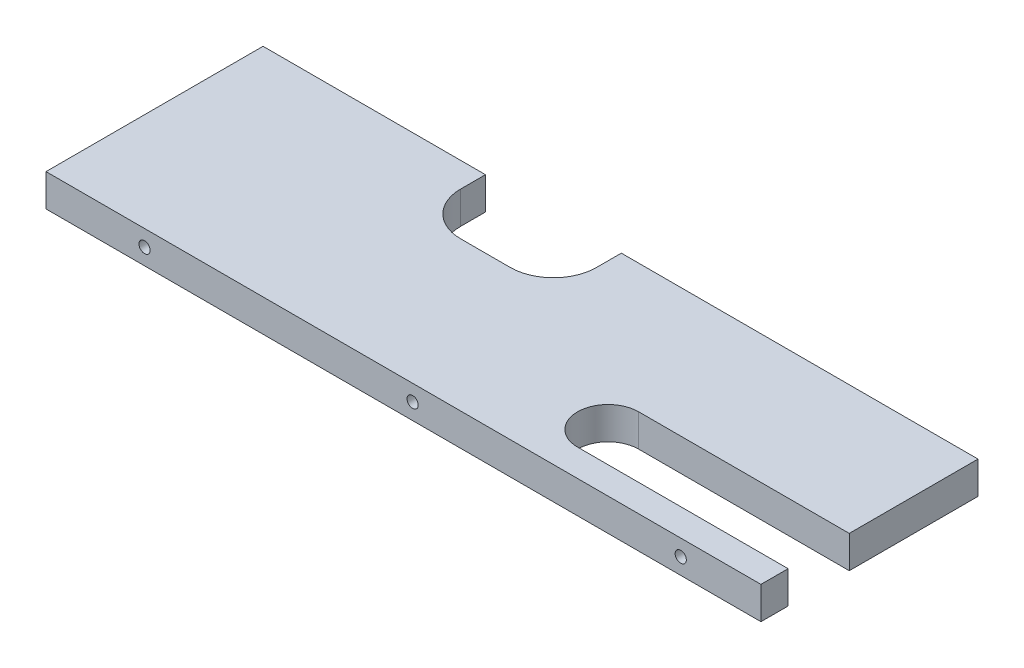
ISO-10303-21;
HEADER;
FILE_DESCRIPTION(('STEP AP214'),'2;1');
FILE_NAME('part.step','',(''),(''),'','','');
FILE_SCHEMA(('AUTOMOTIVE_DESIGN { 1 0 10303 214 1 1 1 1 }'));
ENDSEC;
DATA;
#1=APPLICATION_CONTEXT('core data for automotive mechanical design processes');
#2=APPLICATION_PROTOCOL_DEFINITION('international standard','automotive_design',2000,#1);
#3=PRODUCT_CONTEXT('',#1,'mechanical');
#4=PRODUCT('Part','Part','',(#3));
#5=PRODUCT_RELATED_PRODUCT_CATEGORY('part','',(#4));
#6=PRODUCT_DEFINITION_FORMATION('','',#4);
#7=PRODUCT_DEFINITION_CONTEXT('part definition',#1,'design');
#8=PRODUCT_DEFINITION('design','',#6,#7);
#9=PRODUCT_DEFINITION_SHAPE('','',#8);
#10=(LENGTH_UNIT() NAMED_UNIT(*) SI_UNIT(.MILLI.,.METRE.));
#11=(NAMED_UNIT(*) PLANE_ANGLE_UNIT() SI_UNIT($,.RADIAN.));
#12=(NAMED_UNIT(*) SI_UNIT($,.STERADIAN.) SOLID_ANGLE_UNIT());
#13=UNCERTAINTY_MEASURE_WITH_UNIT(LENGTH_MEASURE(1.E-05),#10,'distance_accuracy_value','');
#14=(GEOMETRIC_REPRESENTATION_CONTEXT(3) GLOBAL_UNCERTAINTY_ASSIGNED_CONTEXT((#13)) GLOBAL_UNIT_ASSIGNED_CONTEXT((#10,
#11,#12)) REPRESENTATION_CONTEXT('',''));
#15=CARTESIAN_POINT('',(0.,0.,0.));
#16=DIRECTION('',(0.,0.,1.));
#17=DIRECTION('',(1.,0.,0.));
#18=AXIS2_PLACEMENT_3D('',#15,#16,#17);
#19=CARTESIAN_POINT('',(105.2375,4.7625,63.9));
#20=DIRECTION('',(-1.,0.,0.));
#21=DIRECTION('',(0.,0.,1.));
#22=AXIS2_PLACEMENT_3D('',#19,#20,#21);
#23=PLANE('',#22);
#24=DIRECTION('',(0.,0.,-1.));
#25=VECTOR('',#24,1.);
#26=CARTESIAN_POINT('',(105.2375,4.7625,63.9));
#27=LINE('',#26,#25);
#28=CARTESIAN_POINT('',(105.2375,4.7625,37.9));
#29=VERTEX_POINT('',#28);
#30=CARTESIAN_POINT('',(105.2375,4.7625,0.));
#31=VERTEX_POINT('',#30);
#32=EDGE_CURVE('E240',#29,#31,#27,.T.);
#33=ORIENTED_EDGE('',*,*,#32,.F.);
#34=DIRECTION('',(0.,1.,0.));
#35=VECTOR('',#34,1.);
#36=CARTESIAN_POINT('',(105.2375,-4.7625,37.9));
#37=LINE('',#36,#35);
#38=CARTESIAN_POINT('',(105.2375,-4.7625,37.9));
#39=VERTEX_POINT('',#38);
#40=EDGE_CURVE('E177',#39,#29,#37,.T.);
#41=ORIENTED_EDGE('',*,*,#40,.F.);
#42=DIRECTION('',(0.,0.,-1.));
#43=VECTOR('',#42,1.);
#44=CARTESIAN_POINT('',(105.2375,-4.7625,63.9));
#45=LINE('',#44,#43);
#46=CARTESIAN_POINT('',(105.2375,-4.7625,0.));
#47=VERTEX_POINT('',#46);
#48=EDGE_CURVE('E244',#39,#47,#45,.T.);
#49=ORIENTED_EDGE('',*,*,#48,.T.);
#50=DIRECTION('',(0.,1.,0.));
#51=VECTOR('',#50,1.);
#52=CARTESIAN_POINT('',(105.2375,4.7625,0.));
#53=LINE('',#52,#51);
#54=EDGE_CURVE('E232',#47,#31,#53,.T.);
#55=ORIENTED_EDGE('',*,*,#54,.T.);
#56=EDGE_LOOP('',(#33,#41,#49,#55));
#57=FACE_BOUND('',#56,.T.);
#58=ADVANCED_FACE('F38',(#57),#23,.F.);
#59=CARTESIAN_POINT('',(0.,0.,0.));
#60=DIRECTION('',(0.,0.,1.));
#61=DIRECTION('',(1.,0.,0.));
#62=AXIS2_PLACEMENT_3D('',#59,#60,#61);
#63=PLANE('',#62);
#64=DIRECTION('',(-1.,0.,0.));
#65=VECTOR('',#64,1.);
#66=CARTESIAN_POINT('',(-105.2375,4.7625,0.));
#67=LINE('',#66,#65);
#68=CARTESIAN_POINT('',(-39.7625,4.7625,0.));
#69=VERTEX_POINT('',#68);
#70=CARTESIAN_POINT('',(-105.2375,4.7625,0.));
#71=VERTEX_POINT('',#70);
#72=EDGE_CURVE('E235',#69,#71,#67,.T.);
#73=ORIENTED_EDGE('',*,*,#72,.F.);
#74=DIRECTION('',(0.,1.,0.));
#75=VECTOR('',#74,1.);
#76=CARTESIAN_POINT('',(-39.7625,-4.7625,0.));
#77=LINE('',#76,#75);
#78=CARTESIAN_POINT('',(-39.7625,-4.7625,0.));
#79=VERTEX_POINT('',#78);
#80=EDGE_CURVE('E210',#79,#69,#77,.T.);
#81=ORIENTED_EDGE('',*,*,#80,.F.);
#82=DIRECTION('',(1.,0.,0.));
#83=VECTOR('',#82,1.);
#84=CARTESIAN_POINT('',(-105.2375,-4.7625,0.));
#85=LINE('',#84,#83);
#86=CARTESIAN_POINT('',(-105.2375,-4.7625,0.));
#87=VERTEX_POINT('',#86);
#88=EDGE_CURVE('E229',#87,#79,#85,.T.);
#89=ORIENTED_EDGE('',*,*,#88,.F.);
#90=DIRECTION('',(0.,-1.,0.));
#91=VECTOR('',#90,1.);
#92=CARTESIAN_POINT('',(-105.2375,4.7625,0.));
#93=LINE('',#92,#91);
#94=EDGE_CURVE('E212',#71,#87,#93,.T.);
#95=ORIENTED_EDGE('',*,*,#94,.F.);
#96=EDGE_LOOP('',(#73,#81,#89,#95));
#97=FACE_BOUND('',#96,.T.);
#98=ADVANCED_FACE('F312',(#97),#63,.F.);
#99=CARTESIAN_POINT('',(-105.2375,4.7625,63.9));
#100=DIRECTION('',(1.,0.,0.));
#101=DIRECTION('',(0.,0.,-1.));
#102=AXIS2_PLACEMENT_3D('',#99,#100,#101);
#103=PLANE('',#102);
#104=ORIENTED_EDGE('',*,*,#94,.T.);
#105=DIRECTION('',(0.,0.,-1.));
#106=VECTOR('',#105,1.);
#107=CARTESIAN_POINT('',(-105.2375,-4.7625,63.9));
#108=LINE('',#107,#106);
#109=CARTESIAN_POINT('',(-105.2375,-4.7625,63.9));
#110=VERTEX_POINT('',#109);
#111=EDGE_CURVE('E247',#110,#87,#108,.T.);
#112=ORIENTED_EDGE('',*,*,#111,.F.);
#113=DIRECTION('',(0.,-1.,0.));
#114=VECTOR('',#113,1.);
#115=CARTESIAN_POINT('',(-105.2375,4.7625,63.9));
#116=LINE('',#115,#114);
#117=CARTESIAN_POINT('',(-105.2375,4.7625,63.9));
#118=VERTEX_POINT('',#117);
#119=EDGE_CURVE('E215',#118,#110,#116,.T.);
#120=ORIENTED_EDGE('',*,*,#119,.F.);
#121=DIRECTION('',(0.,0.,-1.));
#122=VECTOR('',#121,1.);
#123=CARTESIAN_POINT('',(-105.2375,4.7625,63.9));
#124=LINE('',#123,#122);
#125=EDGE_CURVE('E225',#118,#71,#124,.T.);
#126=ORIENTED_EDGE('',*,*,#125,.T.);
#127=EDGE_LOOP('',(#104,#112,#120,#126));
#128=FACE_BOUND('',#127,.T.);
#129=ADVANCED_FACE('F309',(#128),#103,.F.);
#130=CARTESIAN_POINT('',(-105.2375,-4.7625,63.9));
#131=DIRECTION('',(0.,1.,0.));
#132=DIRECTION('',(0.,0.,1.));
#133=AXIS2_PLACEMENT_3D('',#130,#131,#132);
#134=PLANE('',#133);
#135=ORIENTED_EDGE('',*,*,#48,.F.);
#136=DIRECTION('',(-1.,0.,0.));
#137=VECTOR('',#136,1.);
#138=CARTESIAN_POINT('',(43.2375,-4.7625,37.9));
#139=LINE('',#138,#137);
#140=CARTESIAN_POINT('',(43.2375,-4.7625,37.9));
#141=VERTEX_POINT('',#140);
#142=EDGE_CURVE('E153',#39,#141,#139,.T.);
#143=ORIENTED_EDGE('',*,*,#142,.T.);
#144=CARTESIAN_POINT('',(43.2375,-4.7625,46.9));
#145=DIRECTION('',(0.,1.,0.));
#146=DIRECTION('',(0.,0.,1.));
#147=AXIS2_PLACEMENT_3D('',#144,#145,#146);
#148=CIRCLE('',#147,9.);
#149=CARTESIAN_POINT('',(43.2375,-4.7625,55.9));
#150=VERTEX_POINT('',#149);
#151=EDGE_CURVE('E148',#141,#150,#148,.T.);
#152=ORIENTED_EDGE('',*,*,#151,.T.);
#153=DIRECTION('',(1.,0.,0.));
#154=VECTOR('',#153,1.);
#155=CARTESIAN_POINT('',(43.2375,-4.7625,55.9));
#156=LINE('',#155,#154);
#157=CARTESIAN_POINT('',(105.2375,-4.7625,55.9));
#158=VERTEX_POINT('',#157);
#159=EDGE_CURVE('E156',#150,#158,#156,.T.);
#160=ORIENTED_EDGE('',*,*,#159,.T.);
#161=CARTESIAN_POINT('',(105.2375,-4.7625,63.9));
#162=VERTEX_POINT('',#161);
#163=EDGE_CURVE('E245',#162,#158,#45,.T.);
#164=ORIENTED_EDGE('',*,*,#163,.F.);
#165=DIRECTION('',(1.,0.,0.));
#166=VECTOR('',#165,1.);
#167=CARTESIAN_POINT('',(-105.2375,-4.7625,63.9));
#168=LINE('',#167,#166);
#169=EDGE_CURVE('E218',#110,#162,#168,.T.);
#170=ORIENTED_EDGE('',*,*,#169,.F.);
#171=ORIENTED_EDGE('',*,*,#111,.T.);
#172=ORIENTED_EDGE('',*,*,#88,.T.);
#173=DIRECTION('',(0.,0.,1.));
#174=VECTOR('',#173,1.);
#175=CARTESIAN_POINT('',(-39.7625,-4.7625,0.));
#176=LINE('',#175,#174);
#177=CARTESIAN_POINT('',(-39.7625,-4.7625,7.3));
#178=VERTEX_POINT('',#177);
#179=EDGE_CURVE('E196',#79,#178,#176,.T.);
#180=ORIENTED_EDGE('',*,*,#179,.T.);
#181=CARTESIAN_POINT('',(-27.0625,-4.7625,7.3));
#182=DIRECTION('',(0.,1.,0.));
#183=DIRECTION('',(0.,0.,1.));
#184=AXIS2_PLACEMENT_3D('',#181,#182,#183);
#185=CIRCLE('',#184,12.7);
#186=CARTESIAN_POINT('',(-27.0625,-4.7625,20.));
#187=VERTEX_POINT('',#186);
#188=EDGE_CURVE('E11',#178,#187,#185,.T.);
#189=ORIENTED_EDGE('',*,*,#188,.T.);
#190=DIRECTION('',(1.,0.,0.));
#191=VECTOR('',#190,1.);
#192=CARTESIAN_POINT('',(-39.7625,-4.7625,20.));
#193=LINE('',#192,#191);
#194=CARTESIAN_POINT('',(-12.4625,-4.7625,20.));
#195=VERTEX_POINT('',#194);
#196=EDGE_CURVE('E198',#187,#195,#193,.T.);
#197=ORIENTED_EDGE('',*,*,#196,.T.);
#198=CARTESIAN_POINT('',(-12.4625,-4.7625,7.3));
#199=DIRECTION('',(0.,1.,0.));
#200=DIRECTION('',(0.,0.,1.));
#201=AXIS2_PLACEMENT_3D('',#198,#199,#200);
#202=CIRCLE('',#201,12.7);
#203=CARTESIAN_POINT('',(0.237500000000003,-4.7625,7.3));
#204=VERTEX_POINT('',#203);
#205=EDGE_CURVE('E261',#195,#204,#202,.T.);
#206=ORIENTED_EDGE('',*,*,#205,.T.);
#207=DIRECTION('',(0.,0.,-1.));
#208=VECTOR('',#207,1.);
#209=CARTESIAN_POINT('',(0.237500000000002,-4.7625,0.));
#210=LINE('',#209,#208);
#211=CARTESIAN_POINT('',(0.237500000000002,-4.7625,0.));
#212=VERTEX_POINT('',#211);
#213=EDGE_CURVE('E202',#204,#212,#210,.T.);
#214=ORIENTED_EDGE('',*,*,#213,.T.);
#215=EDGE_CURVE('E228',#212,#47,#85,.T.);
#216=ORIENTED_EDGE('',*,*,#215,.T.);
#217=EDGE_LOOP('',(#135,#143,#152,#160,#164,#170,#171,#172,#180,#189,#197,#206,#214,#216));
#218=FACE_BOUND('',#217,.T.);
#219=ADVANCED_FACE('F165',(#218),#134,.F.);
#220=ORIENTED_EDGE('',*,*,#163,.T.);
#221=DIRECTION('',(0.,1.,0.));
#222=VECTOR('',#221,1.);
#223=CARTESIAN_POINT('',(105.2375,-4.7625,55.9));
#224=LINE('',#223,#222);
#225=CARTESIAN_POINT('',(105.2375,4.7625,55.9));
#226=VERTEX_POINT('',#225);
#227=EDGE_CURVE('E152',#158,#226,#224,.T.);
#228=ORIENTED_EDGE('',*,*,#227,.T.);
#229=CARTESIAN_POINT('',(105.2375,4.7625,63.9));
#230=VERTEX_POINT('',#229);
#231=EDGE_CURVE('E241',#230,#226,#27,.T.);
#232=ORIENTED_EDGE('',*,*,#231,.F.);
#233=DIRECTION('',(0.,1.,0.));
#234=VECTOR('',#233,1.);
#235=CARTESIAN_POINT('',(105.2375,4.7625,63.9));
#236=LINE('',#235,#234);
#237=EDGE_CURVE('E221',#162,#230,#236,.T.);
#238=ORIENTED_EDGE('',*,*,#237,.F.);
#239=EDGE_LOOP('',(#220,#228,#232,#238));
#240=FACE_BOUND('',#239,.T.);
#241=ADVANCED_FACE('F301',(#240),#23,.F.);
#242=CARTESIAN_POINT('',(-105.2375,4.7625,63.9));
#243=DIRECTION('',(0.,-1.,0.));
#244=DIRECTION('',(0.,0.,-1.));
#245=AXIS2_PLACEMENT_3D('',#242,#243,#244);
#246=PLANE('',#245);
#247=CARTESIAN_POINT('',(43.2375,4.7625,46.9));
#248=DIRECTION('',(0.,1.,0.));
#249=DIRECTION('',(0.,0.,1.));
#250=AXIS2_PLACEMENT_3D('',#247,#248,#249);
#251=CIRCLE('',#250,9.);
#252=CARTESIAN_POINT('',(43.2375,4.7625,37.9));
#253=VERTEX_POINT('',#252);
#254=CARTESIAN_POINT('',(43.2375,4.7625,55.9));
#255=VERTEX_POINT('',#254);
#256=EDGE_CURVE('E54',#253,#255,#251,.T.);
#257=ORIENTED_EDGE('',*,*,#256,.F.);
#258=DIRECTION('',(-1.,0.,0.));
#259=VECTOR('',#258,1.);
#260=CARTESIAN_POINT('',(43.2375,4.7625,37.9));
#261=LINE('',#260,#259);
#262=EDGE_CURVE('E166',#29,#253,#261,.T.);
#263=ORIENTED_EDGE('',*,*,#262,.F.);
#264=ORIENTED_EDGE('',*,*,#32,.T.);
#265=CARTESIAN_POINT('',(0.237500000000002,4.7625,0.));
#266=VERTEX_POINT('',#265);
#267=EDGE_CURVE('E219',#31,#266,#67,.T.);
#268=ORIENTED_EDGE('',*,*,#267,.T.);
#269=DIRECTION('',(0.,0.,-1.));
#270=VECTOR('',#269,1.);
#271=CARTESIAN_POINT('',(0.237500000000002,4.7625,0.));
#272=LINE('',#271,#270);
#273=CARTESIAN_POINT('',(0.237500000000003,4.7625,7.3));
#274=VERTEX_POINT('',#273);
#275=EDGE_CURVE('E199',#274,#266,#272,.T.);
#276=ORIENTED_EDGE('',*,*,#275,.F.);
#277=CARTESIAN_POINT('',(-12.4625,4.7625,7.3));
#278=DIRECTION('',(0.,-1.,0.));
#279=DIRECTION('',(0.,0.,-1.));
#280=AXIS2_PLACEMENT_3D('',#277,#278,#279);
#281=CIRCLE('',#280,12.7);
#282=CARTESIAN_POINT('',(-12.4625,4.7625,20.));
#283=VERTEX_POINT('',#282);
#284=EDGE_CURVE('E259',#274,#283,#281,.T.);
#285=ORIENTED_EDGE('',*,*,#284,.T.);
#286=DIRECTION('',(1.,0.,0.));
#287=VECTOR('',#286,1.);
#288=CARTESIAN_POINT('',(-39.7625,4.7625,20.));
#289=LINE('',#288,#287);
#290=CARTESIAN_POINT('',(-27.0625,4.7625,20.));
#291=VERTEX_POINT('',#290);
#292=EDGE_CURVE('E206',#291,#283,#289,.T.);
#293=ORIENTED_EDGE('',*,*,#292,.F.);
#294=CARTESIAN_POINT('',(-27.0625,4.7625,7.3));
#295=DIRECTION('',(0.,-1.,0.));
#296=DIRECTION('',(0.,0.,-1.));
#297=AXIS2_PLACEMENT_3D('',#294,#295,#296);
#298=CIRCLE('',#297,12.7);
#299=CARTESIAN_POINT('',(-39.7625,4.7625,7.3));
#300=VERTEX_POINT('',#299);
#301=EDGE_CURVE('E47',#291,#300,#298,.T.);
#302=ORIENTED_EDGE('',*,*,#301,.T.);
#303=DIRECTION('',(0.,0.,1.));
#304=VECTOR('',#303,1.);
#305=CARTESIAN_POINT('',(-39.7625,4.7625,0.));
#306=LINE('',#305,#304);
#307=EDGE_CURVE('E195',#69,#300,#306,.T.);
#308=ORIENTED_EDGE('',*,*,#307,.F.);
#309=ORIENTED_EDGE('',*,*,#72,.T.);
#310=ORIENTED_EDGE('',*,*,#125,.F.);
#311=DIRECTION('',(-1.,0.,0.));
#312=VECTOR('',#311,1.);
#313=CARTESIAN_POINT('',(-105.2375,4.7625,63.9));
#314=LINE('',#313,#312);
#315=EDGE_CURVE('E223',#230,#118,#314,.T.);
#316=ORIENTED_EDGE('',*,*,#315,.F.);
#317=ORIENTED_EDGE('',*,*,#231,.T.);
#318=DIRECTION('',(1.,0.,0.));
#319=VECTOR('',#318,1.);
#320=CARTESIAN_POINT('',(43.2375,4.7625,55.9));
#321=LINE('',#320,#319);
#322=EDGE_CURVE('E169',#255,#226,#321,.T.);
#323=ORIENTED_EDGE('',*,*,#322,.F.);
#324=EDGE_LOOP('',(#257,#263,#264,#268,#276,#285,#293,#302,#308,#309,#310,#316,#317,#323));
#325=FACE_BOUND('',#324,.T.);
#326=ADVANCED_FACE('F266',(#325),#246,.F.);
#327=CARTESIAN_POINT('',(0.,0.,63.9));
#328=DIRECTION('',(0.,0.,1.));
#329=DIRECTION('',(1.,0.,0.));
#330=AXIS2_PLACEMENT_3D('',#327,#328,#329);
#331=PLANE('',#330);
#332=CARTESIAN_POINT('',(-76.2285,0.,63.9));
#333=DIRECTION('',(0.,0.,1.));
#334=DIRECTION('',(1.,0.,0.));
#335=AXIS2_PLACEMENT_3D('',#332,#333,#334);
#336=CIRCLE('',#335,1.65);
#337=CARTESIAN_POINT('',(-74.5785,0.,63.9));
#338=VERTEX_POINT('',#337);
#339=EDGE_CURVE('E180',#338,#338,#336,.T.);
#340=ORIENTED_EDGE('',*,*,#339,.F.);
#341=EDGE_LOOP('',(#340));
#342=FACE_BOUND('',#341,.T.);
#343=CARTESIAN_POINT('',(2.69949999999999,0.,63.9));
#344=DIRECTION('',(0.,0.,1.));
#345=DIRECTION('',(1.,0.,0.));
#346=AXIS2_PLACEMENT_3D('',#343,#344,#345);
#347=CIRCLE('',#346,1.64999999999999);
#348=CARTESIAN_POINT('',(4.34949999999999,0.,63.9));
#349=VERTEX_POINT('',#348);
#350=EDGE_CURVE('E186',#349,#349,#347,.T.);
#351=ORIENTED_EDGE('',*,*,#350,.F.);
#352=EDGE_LOOP('',(#351));
#353=FACE_BOUND('',#352,.T.);
#354=CARTESIAN_POINT('',(81.6285,0.,63.9));
#355=DIRECTION('',(0.,0.,1.));
#356=DIRECTION('',(1.,0.,0.));
#357=AXIS2_PLACEMENT_3D('',#354,#355,#356);
#358=CIRCLE('',#357,1.65);
#359=CARTESIAN_POINT('',(83.2785,0.,63.9));
#360=VERTEX_POINT('',#359);
#361=EDGE_CURVE('E192',#360,#360,#358,.T.);
#362=ORIENTED_EDGE('',*,*,#361,.F.);
#363=EDGE_LOOP('',(#362));
#364=FACE_BOUND('',#363,.T.);
#365=ORIENTED_EDGE('',*,*,#119,.T.);
#366=ORIENTED_EDGE('',*,*,#169,.T.);
#367=ORIENTED_EDGE('',*,*,#237,.T.);
#368=ORIENTED_EDGE('',*,*,#315,.T.);
#369=EDGE_LOOP('',(#365,#366,#367,#368));
#370=FACE_BOUND('',#369,.T.);
#371=ADVANCED_FACE('F306',(#342,#353,#364,#370),#331,.T.);
#372=ORIENTED_EDGE('',*,*,#215,.F.);
#373=DIRECTION('',(0.,1.,0.));
#374=VECTOR('',#373,1.);
#375=CARTESIAN_POINT('',(0.237500000000002,-4.7625,0.));
#376=LINE('',#375,#374);
#377=EDGE_CURVE('E204',#212,#266,#376,.T.);
#378=ORIENTED_EDGE('',*,*,#377,.T.);
#379=ORIENTED_EDGE('',*,*,#267,.F.);
#380=ORIENTED_EDGE('',*,*,#54,.F.);
#381=EDGE_LOOP('',(#372,#378,#379,#380));
#382=FACE_BOUND('',#381,.T.);
#383=ADVANCED_FACE('F291',(#382),#63,.F.);
#384=CARTESIAN_POINT('',(-39.7625,-4.7625,0.));
#385=DIRECTION('',(-1.,0.,0.));
#386=DIRECTION('',(0.,0.,1.));
#387=AXIS2_PLACEMENT_3D('',#384,#385,#386);
#388=PLANE('',#387);
#389=ORIENTED_EDGE('',*,*,#307,.T.);
#390=DIRECTION('',(0.,1.,0.));
#391=VECTOR('',#390,1.);
#392=CARTESIAN_POINT('',(-39.7625,-4.7625,7.3));
#393=LINE('',#392,#391);
#394=EDGE_CURVE('E62',#300,#178,#393,.F.);
#395=ORIENTED_EDGE('',*,*,#394,.T.);
#396=ORIENTED_EDGE('',*,*,#179,.F.);
#397=ORIENTED_EDGE('',*,*,#80,.T.);
#398=EDGE_LOOP('',(#389,#395,#396,#397));
#399=FACE_BOUND('',#398,.T.);
#400=ADVANCED_FACE('F270',(#399),#388,.F.);
#401=CARTESIAN_POINT('',(0.237500000000002,-4.7625,0.));
#402=DIRECTION('',(1.,0.,0.));
#403=DIRECTION('',(0.,0.,-1.));
#404=AXIS2_PLACEMENT_3D('',#401,#402,#403);
#405=PLANE('',#404);
#406=ORIENTED_EDGE('',*,*,#213,.F.);
#407=DIRECTION('',(0.,1.,0.));
#408=VECTOR('',#407,1.);
#409=CARTESIAN_POINT('',(0.237500000000003,4.7625,7.3));
#410=LINE('',#409,#408);
#411=EDGE_CURVE('E250',#204,#274,#410,.T.);
#412=ORIENTED_EDGE('',*,*,#411,.T.);
#413=ORIENTED_EDGE('',*,*,#275,.T.);
#414=ORIENTED_EDGE('',*,*,#377,.F.);
#415=EDGE_LOOP('',(#406,#412,#413,#414));
#416=FACE_BOUND('',#415,.T.);
#417=ADVANCED_FACE('F285',(#416),#405,.F.);
#418=CARTESIAN_POINT('',(-39.7625,-4.7625,20.));
#419=DIRECTION('',(0.,0.,1.));
#420=DIRECTION('',(1.,0.,0.));
#421=AXIS2_PLACEMENT_3D('',#418,#419,#420);
#422=PLANE('',#421);
#423=ORIENTED_EDGE('',*,*,#292,.T.);
#424=DIRECTION('',(0.,1.,0.));
#425=VECTOR('',#424,1.);
#426=CARTESIAN_POINT('',(-12.4625,-4.7625,20.));
#427=LINE('',#426,#425);
#428=EDGE_CURVE('E256',#283,#195,#427,.F.);
#429=ORIENTED_EDGE('',*,*,#428,.T.);
#430=ORIENTED_EDGE('',*,*,#196,.F.);
#431=DIRECTION('',(0.,1.,0.));
#432=VECTOR('',#431,1.);
#433=CARTESIAN_POINT('',(-27.0625,4.7625,20.));
#434=LINE('',#433,#432);
#435=EDGE_CURVE('E253',#187,#291,#434,.T.);
#436=ORIENTED_EDGE('',*,*,#435,.T.);
#437=EDGE_LOOP('',(#423,#429,#430,#436));
#438=FACE_BOUND('',#437,.T.);
#439=ADVANCED_FACE('F276',(#438),#422,.F.);
#440=CARTESIAN_POINT('',(-12.4625,-4.7625,7.3));
#441=DIRECTION('',(0.,-1.,0.));
#442=DIRECTION('',(0.,0.,-1.));
#443=AXIS2_PLACEMENT_3D('',#440,#441,#442);
#444=CYLINDRICAL_SURFACE('',#443,12.7);
#445=ORIENTED_EDGE('',*,*,#205,.F.);
#446=ORIENTED_EDGE('',*,*,#428,.F.);
#447=ORIENTED_EDGE('',*,*,#284,.F.);
#448=ORIENTED_EDGE('',*,*,#411,.F.);
#449=EDGE_LOOP('',(#445,#446,#447,#448));
#450=FACE_BOUND('',#449,.T.);
#451=ADVANCED_FACE('F279',(#450),#444,.F.);
#452=CARTESIAN_POINT('',(-27.0625,-4.7625,7.3));
#453=DIRECTION('',(0.,-1.,0.));
#454=DIRECTION('',(0.,0.,-1.));
#455=AXIS2_PLACEMENT_3D('',#452,#453,#454);
#456=CYLINDRICAL_SURFACE('',#455,12.7);
#457=ORIENTED_EDGE('',*,*,#188,.F.);
#458=ORIENTED_EDGE('',*,*,#394,.F.);
#459=ORIENTED_EDGE('',*,*,#301,.F.);
#460=ORIENTED_EDGE('',*,*,#435,.F.);
#461=EDGE_LOOP('',(#457,#458,#459,#460));
#462=FACE_BOUND('',#461,.T.);
#463=ADVANCED_FACE('F40',(#462),#456,.F.);
#464=CARTESIAN_POINT('',(81.6285,0.,63.9));
#465=DIRECTION('',(0.,0.,1.));
#466=DIRECTION('',(1.,0.,0.));
#467=AXIS2_PLACEMENT_3D('',#464,#465,#466);
#468=CYLINDRICAL_SURFACE('',#467,1.65);
#469=CARTESIAN_POINT('',(81.6285,0.,55.9));
#470=DIRECTION('',(0.,0.,1.));
#471=DIRECTION('',(1.,0.,0.));
#472=AXIS2_PLACEMENT_3D('',#469,#470,#471);
#473=CIRCLE('',#472,1.65);
#474=CARTESIAN_POINT('',(83.2785,0.,55.9));
#475=VERTEX_POINT('',#474);
#476=EDGE_CURVE('E42',#475,#475,#473,.F.);
#477=ORIENTED_EDGE('',*,*,#476,.T.);
#478=EDGE_LOOP('',(#477));
#479=FACE_BOUND('',#478,.T.);
#480=ORIENTED_EDGE('',*,*,#361,.T.);
#481=EDGE_LOOP('',(#480));
#482=FACE_BOUND('',#481,.T.);
#483=ADVANCED_FACE('F340',(#479,#482),#468,.F.);
#484=CARTESIAN_POINT('',(2.69949999999999,0.,51.2));
#485=DIRECTION('',(0.,0.,1.));
#486=DIRECTION('',(1.,0.,0.));
#487=AXIS2_PLACEMENT_3D('',#484,#485,#486);
#488=CONICAL_SURFACE('',#487,1.64999999999999,1.02974425867665);
#489=CARTESIAN_POINT('',(2.69949999999999,0.,50.2085799786045));
#490=VERTEX_POINT('',#489);
#491=VERTEX_LOOP('',#490);
#492=FACE_BOUND('',#491,.T.);
#493=CARTESIAN_POINT('',(2.69949999999999,0.,51.2));
#494=DIRECTION('',(0.,0.,1.));
#495=DIRECTION('',(1.,0.,0.));
#496=AXIS2_PLACEMENT_3D('',#493,#494,#495);
#497=CIRCLE('',#496,1.64999999999999);
#498=CARTESIAN_POINT('',(4.34949999999999,0.,51.2));
#499=VERTEX_POINT('',#498);
#500=EDGE_CURVE('E189',#499,#499,#497,.T.);
#501=ORIENTED_EDGE('',*,*,#500,.T.);
#502=EDGE_LOOP('',(#501));
#503=FACE_BOUND('',#502,.T.);
#504=ADVANCED_FACE('F343',(#492,#503),#488,.F.);
#505=CARTESIAN_POINT('',(2.69949999999999,0.,63.9));
#506=DIRECTION('',(0.,0.,1.));
#507=DIRECTION('',(1.,0.,0.));
#508=AXIS2_PLACEMENT_3D('',#505,#506,#507);
#509=CYLINDRICAL_SURFACE('',#508,1.64999999999999);
#510=ORIENTED_EDGE('',*,*,#500,.F.);
#511=EDGE_LOOP('',(#510));
#512=FACE_BOUND('',#511,.T.);
#513=ORIENTED_EDGE('',*,*,#350,.T.);
#514=EDGE_LOOP('',(#513));
#515=FACE_BOUND('',#514,.T.);
#516=ADVANCED_FACE('F347',(#512,#515),#509,.F.);
#517=CARTESIAN_POINT('',(-76.2285,0.,51.2));
#518=DIRECTION('',(0.,0.,1.));
#519=DIRECTION('',(1.,0.,0.));
#520=AXIS2_PLACEMENT_3D('',#517,#518,#519);
#521=CONICAL_SURFACE('',#520,1.65,1.02974425867665);
#522=CARTESIAN_POINT('',(-76.2285,0.,50.2085799786045));
#523=VERTEX_POINT('',#522);
#524=VERTEX_LOOP('',#523);
#525=FACE_BOUND('',#524,.T.);
#526=CARTESIAN_POINT('',(-76.2285,0.,51.2));
#527=DIRECTION('',(0.,0.,1.));
#528=DIRECTION('',(1.,0.,0.));
#529=AXIS2_PLACEMENT_3D('',#526,#527,#528);
#530=CIRCLE('',#529,1.65);
#531=CARTESIAN_POINT('',(-74.5785,0.,51.2));
#532=VERTEX_POINT('',#531);
#533=EDGE_CURVE('E183',#532,#532,#530,.T.);
#534=ORIENTED_EDGE('',*,*,#533,.T.);
#535=EDGE_LOOP('',(#534));
#536=FACE_BOUND('',#535,.T.);
#537=ADVANCED_FACE('F351',(#525,#536),#521,.F.);
#538=CARTESIAN_POINT('',(-76.2285,0.,63.9));
#539=DIRECTION('',(0.,0.,1.));
#540=DIRECTION('',(1.,0.,0.));
#541=AXIS2_PLACEMENT_3D('',#538,#539,#540);
#542=CYLINDRICAL_SURFACE('',#541,1.65);
#543=ORIENTED_EDGE('',*,*,#533,.F.);
#544=EDGE_LOOP('',(#543));
#545=FACE_BOUND('',#544,.T.);
#546=ORIENTED_EDGE('',*,*,#339,.T.);
#547=EDGE_LOOP('',(#546));
#548=FACE_BOUND('',#547,.T.);
#549=ADVANCED_FACE('F355',(#545,#548),#542,.F.);
#550=CARTESIAN_POINT('',(43.2375,-4.7625,55.9));
#551=DIRECTION('',(0.,0.,1.));
#552=DIRECTION('',(1.,0.,0.));
#553=AXIS2_PLACEMENT_3D('',#550,#551,#552);
#554=PLANE('',#553);
#555=ORIENTED_EDGE('',*,*,#322,.T.);
#556=ORIENTED_EDGE('',*,*,#227,.F.);
#557=ORIENTED_EDGE('',*,*,#159,.F.);
#558=DIRECTION('',(0.,1.,0.));
#559=VECTOR('',#558,1.);
#560=CARTESIAN_POINT('',(43.2375,-4.7625,55.9));
#561=LINE('',#560,#559);
#562=EDGE_CURVE('E144',#150,#255,#561,.T.);
#563=ORIENTED_EDGE('',*,*,#562,.T.);
#564=EDGE_LOOP('',(#555,#556,#557,#563));
#565=FACE_BOUND('',#564,.T.);
#566=ORIENTED_EDGE('',*,*,#476,.F.);
#567=EDGE_LOOP('',(#566));
#568=FACE_BOUND('',#567,.T.);
#569=ADVANCED_FACE('F157',(#565,#568),#554,.F.);
#570=CARTESIAN_POINT('',(43.2375,-4.7625,46.9));
#571=DIRECTION('',(0.,1.,0.));
#572=DIRECTION('',(0.,0.,1.));
#573=AXIS2_PLACEMENT_3D('',#570,#571,#572);
#574=CYLINDRICAL_SURFACE('',#573,9.);
#575=ORIENTED_EDGE('',*,*,#256,.T.);
#576=ORIENTED_EDGE('',*,*,#562,.F.);
#577=ORIENTED_EDGE('',*,*,#151,.F.);
#578=DIRECTION('',(0.,1.,0.));
#579=VECTOR('',#578,1.);
#580=CARTESIAN_POINT('',(43.2375,-4.7625,37.9));
#581=LINE('',#580,#579);
#582=EDGE_CURVE('E175',#141,#253,#581,.T.);
#583=ORIENTED_EDGE('',*,*,#582,.T.);
#584=EDGE_LOOP('',(#575,#576,#577,#583));
#585=FACE_BOUND('',#584,.T.);
#586=ADVANCED_FACE('F146',(#585),#574,.F.);
#587=CARTESIAN_POINT('',(43.2375,-4.7625,37.9));
#588=DIRECTION('',(0.,0.,-1.));
#589=DIRECTION('',(-1.,0.,0.));
#590=AXIS2_PLACEMENT_3D('',#587,#588,#589);
#591=PLANE('',#590);
#592=ORIENTED_EDGE('',*,*,#262,.T.);
#593=ORIENTED_EDGE('',*,*,#582,.F.);
#594=ORIENTED_EDGE('',*,*,#142,.F.);
#595=ORIENTED_EDGE('',*,*,#40,.T.);
#596=EDGE_LOOP('',(#592,#593,#594,#595));
#597=FACE_BOUND('',#596,.T.);
#598=ADVANCED_FACE('F297',(#597),#591,.F.);
#599=CLOSED_SHELL('',(#58,#98,#129,#219,#241,#326,#371,#383,#400,#417,#439,#451,#463,#483,#504,
#516,#537,#549,#569,#586,#598));
#600=MANIFOLD_SOLID_BREP('B2',#599);
#601=ADVANCED_BREP_SHAPE_REPRESENTATION('',(#18,#600),#14);
#602=SHAPE_DEFINITION_REPRESENTATION(#9,#601);
ENDSEC;
END-ISO-10303-21;
